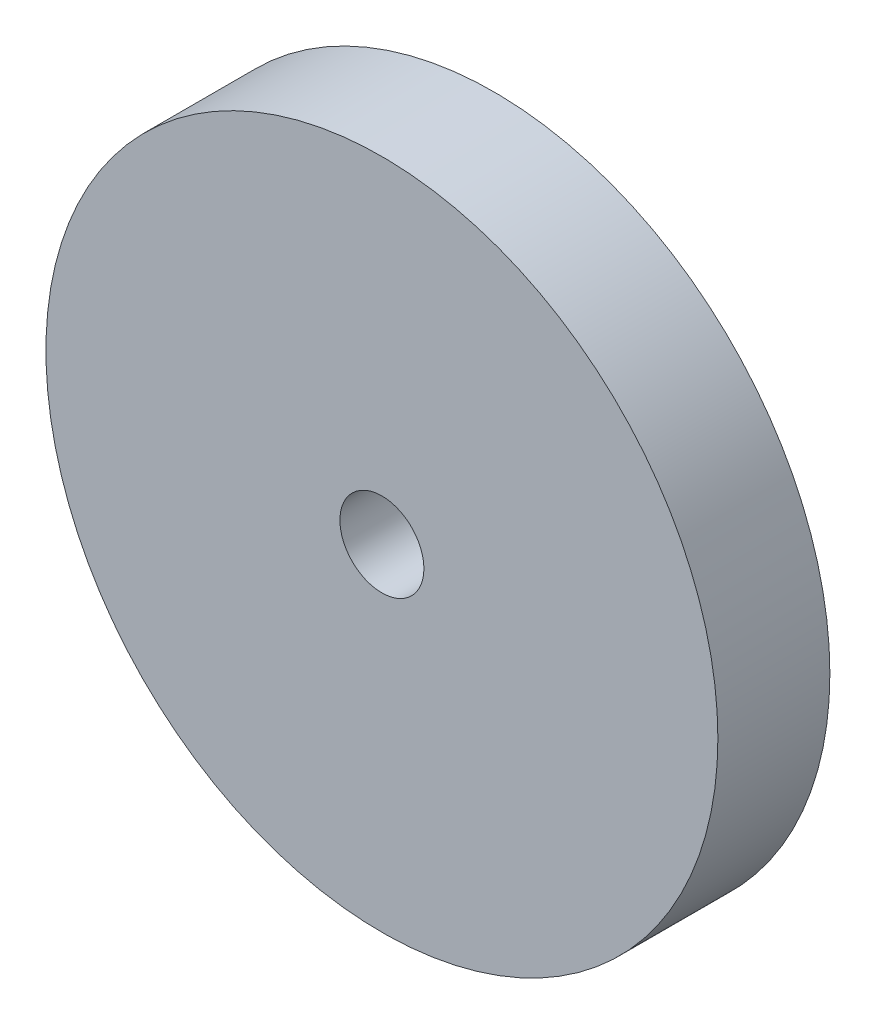
ISO-10303-21;
HEADER;
FILE_DESCRIPTION(('STEP AP214'),'2;1');
FILE_NAME('part.step','',(''),(''),'','','');
FILE_SCHEMA(('AUTOMOTIVE_DESIGN { 1 0 10303 214 1 1 1 1 }'));
ENDSEC;
DATA;
#1=APPLICATION_CONTEXT('core data for automotive mechanical design processes');
#2=APPLICATION_PROTOCOL_DEFINITION('international standard','automotive_design',2000,#1);
#3=PRODUCT_CONTEXT('',#1,'mechanical');
#4=PRODUCT('Part','Part','',(#3));
#5=PRODUCT_RELATED_PRODUCT_CATEGORY('part','',(#4));
#6=PRODUCT_DEFINITION_FORMATION('','',#4);
#7=PRODUCT_DEFINITION_CONTEXT('part definition',#1,'design');
#8=PRODUCT_DEFINITION('design','',#6,#7);
#9=PRODUCT_DEFINITION_SHAPE('','',#8);
#10=(LENGTH_UNIT() NAMED_UNIT(*) SI_UNIT(.MILLI.,.METRE.));
#11=(NAMED_UNIT(*) PLANE_ANGLE_UNIT() SI_UNIT($,.RADIAN.));
#12=(NAMED_UNIT(*) SI_UNIT($,.STERADIAN.) SOLID_ANGLE_UNIT());
#13=UNCERTAINTY_MEASURE_WITH_UNIT(LENGTH_MEASURE(1.E-05),#10,'distance_accuracy_value','');
#14=(GEOMETRIC_REPRESENTATION_CONTEXT(3) GLOBAL_UNCERTAINTY_ASSIGNED_CONTEXT((#13)) GLOBAL_UNIT_ASSIGNED_CONTEXT((#10,
#11,#12)) REPRESENTATION_CONTEXT('',''));
#15=CARTESIAN_POINT('',(0.,0.,0.));
#16=DIRECTION('',(0.,0.,1.));
#17=DIRECTION('',(1.,0.,0.));
#18=AXIS2_PLACEMENT_3D('',#15,#16,#17);
#19=CARTESIAN_POINT('',(0.,0.,25.4));
#20=DIRECTION('',(0.,0.,1.));
#21=DIRECTION('',(1.,0.,0.));
#22=AXIS2_PLACEMENT_3D('',#19,#20,#21);
#23=PLANE('',#22);
#24=CARTESIAN_POINT('',(0.,0.,25.4));
#25=DIRECTION('',(0.,0.,1.));
#26=DIRECTION('',(1.,0.,0.));
#27=AXIS2_PLACEMENT_3D('',#24,#25,#26);
#28=CIRCLE('',#27,76.2);
#29=CARTESIAN_POINT('',(76.2,0.,25.4));
#30=VERTEX_POINT('',#29);
#31=EDGE_CURVE('E10',#30,#30,#28,.T.);
#32=ORIENTED_EDGE('',*,*,#31,.T.);
#33=EDGE_LOOP('',(#32));
#34=FACE_BOUND('',#33,.T.);
#35=CARTESIAN_POINT('',(0.,0.,25.4));
#36=DIRECTION('',(0.,0.,1.));
#37=DIRECTION('',(1.,0.,0.));
#38=AXIS2_PLACEMENT_3D('',#35,#36,#37);
#39=CIRCLE('',#38,9.525);
#40=CARTESIAN_POINT('',(9.525,0.,25.4));
#41=VERTEX_POINT('',#40);
#42=EDGE_CURVE('E42',#41,#41,#39,.T.);
#43=ORIENTED_EDGE('',*,*,#42,.F.);
#44=EDGE_LOOP('',(#43));
#45=FACE_BOUND('',#44,.T.);
#46=ADVANCED_FACE('F31',(#34,#45),#23,.T.);
#47=CARTESIAN_POINT('',(0.,0.,0.));
#48=DIRECTION('',(0.,0.,1.));
#49=DIRECTION('',(1.,0.,0.));
#50=AXIS2_PLACEMENT_3D('',#47,#48,#49);
#51=PLANE('',#50);
#52=CARTESIAN_POINT('',(0.,0.,0.));
#53=DIRECTION('',(0.,0.,1.));
#54=DIRECTION('',(1.,0.,0.));
#55=AXIS2_PLACEMENT_3D('',#52,#53,#54);
#56=CIRCLE('',#55,31.75);
#57=CARTESIAN_POINT('',(31.75,0.,0.));
#58=VERTEX_POINT('',#57);
#59=EDGE_CURVE('E50',#58,#58,#56,.T.);
#60=ORIENTED_EDGE('',*,*,#59,.T.);
#61=EDGE_LOOP('',(#60));
#62=FACE_BOUND('',#61,.T.);
#63=CARTESIAN_POINT('',(0.,0.,0.));
#64=DIRECTION('',(0.,0.,1.));
#65=DIRECTION('',(1.,0.,0.));
#66=AXIS2_PLACEMENT_3D('',#63,#64,#65);
#67=CIRCLE('',#66,76.2);
#68=CARTESIAN_POINT('',(76.2,0.,0.));
#69=VERTEX_POINT('',#68);
#70=EDGE_CURVE('E35',#69,#69,#67,.T.);
#71=ORIENTED_EDGE('',*,*,#70,.F.);
#72=EDGE_LOOP('',(#71));
#73=FACE_BOUND('',#72,.T.);
#74=ADVANCED_FACE('F69',(#62,#73),#51,.F.);
#75=CARTESIAN_POINT('',(0.,0.,25.4));
#76=DIRECTION('',(0.,0.,-1.));
#77=DIRECTION('',(-1.,0.,0.));
#78=AXIS2_PLACEMENT_3D('',#75,#76,#77);
#79=CYLINDRICAL_SURFACE('',#78,76.2);
#80=ORIENTED_EDGE('',*,*,#31,.F.);
#81=EDGE_LOOP('',(#80));
#82=FACE_BOUND('',#81,.T.);
#83=ORIENTED_EDGE('',*,*,#70,.T.);
#84=EDGE_LOOP('',(#83));
#85=FACE_BOUND('',#84,.T.);
#86=ADVANCED_FACE('F33',(#82,#85),#79,.T.);
#87=CARTESIAN_POINT('',(0.,0.,25.4));
#88=DIRECTION('',(0.,0.,-1.));
#89=DIRECTION('',(-1.,0.,0.));
#90=AXIS2_PLACEMENT_3D('',#87,#88,#89);
#91=CYLINDRICAL_SURFACE('',#90,9.525);
#92=ORIENTED_EDGE('',*,*,#42,.T.);
#93=EDGE_LOOP('',(#92));
#94=FACE_BOUND('',#93,.T.);
#95=CARTESIAN_POINT('',(0.,0.,0.));
#96=DIRECTION('',(0.,0.,1.));
#97=DIRECTION('',(1.,0.,0.));
#98=AXIS2_PLACEMENT_3D('',#95,#96,#97);
#99=CIRCLE('',#98,9.525);
#100=CARTESIAN_POINT('',(9.525,0.,0.));
#101=VERTEX_POINT('',#100);
#102=EDGE_CURVE('E44',#101,#101,#99,.T.);
#103=ORIENTED_EDGE('',*,*,#102,.F.);
#104=EDGE_LOOP('',(#103));
#105=FACE_BOUND('',#104,.T.);
#106=ADVANCED_FACE('F78',(#94,#105),#91,.F.);
#107=CARTESIAN_POINT('',(0.,0.,0.));
#108=DIRECTION('',(0.,0.,1.));
#109=DIRECTION('',(1.,0.,0.));
#110=AXIS2_PLACEMENT_3D('',#107,#108,#109);
#111=PLANE('',#110);
#112=ORIENTED_EDGE('',*,*,#102,.T.);
#113=EDGE_LOOP('',(#112));
#114=FACE_BOUND('',#113,.T.);
#115=ADVANCED_FACE('F65',(#114),#111,.T.);
#116=CARTESIAN_POINT('',(0.,0.,-22.225));
#117=DIRECTION('',(0.,0.,1.));
#118=DIRECTION('',(1.,0.,0.));
#119=AXIS2_PLACEMENT_3D('',#116,#117,#118);
#120=CYLINDRICAL_SURFACE('',#119,31.75);
#121=CARTESIAN_POINT('',(0.,0.,-22.225));
#122=DIRECTION('',(0.,0.,1.));
#123=DIRECTION('',(1.,0.,0.));
#124=AXIS2_PLACEMENT_3D('',#121,#122,#123);
#125=CIRCLE('',#124,31.75);
#126=CARTESIAN_POINT('',(31.75,0.,-22.225));
#127=VERTEX_POINT('',#126);
#128=EDGE_CURVE('E47',#127,#127,#125,.T.);
#129=ORIENTED_EDGE('',*,*,#128,.T.);
#130=EDGE_LOOP('',(#129));
#131=FACE_BOUND('',#130,.T.);
#132=ORIENTED_EDGE('',*,*,#59,.F.);
#133=EDGE_LOOP('',(#132));
#134=FACE_BOUND('',#133,.T.);
#135=ADVANCED_FACE('F56',(#131,#134),#120,.T.);
#136=CARTESIAN_POINT('',(0.,0.,-22.225));
#137=DIRECTION('',(0.,0.,1.));
#138=DIRECTION('',(1.,0.,0.));
#139=AXIS2_PLACEMENT_3D('',#136,#137,#138);
#140=PLANE('',#139);
#141=ORIENTED_EDGE('',*,*,#128,.F.);
#142=EDGE_LOOP('',(#141));
#143=FACE_BOUND('',#142,.T.);
#144=ADVANCED_FACE('F59',(#143),#140,.F.);
#145=CLOSED_SHELL('',(#46,#74,#86,#106,#115,#135,#144));
#146=MANIFOLD_SOLID_BREP('B2',#145);
#147=ADVANCED_BREP_SHAPE_REPRESENTATION('',(#18,#146),#14);
#148=SHAPE_DEFINITION_REPRESENTATION(#9,#147);
ENDSEC;
END-ISO-10303-21;
